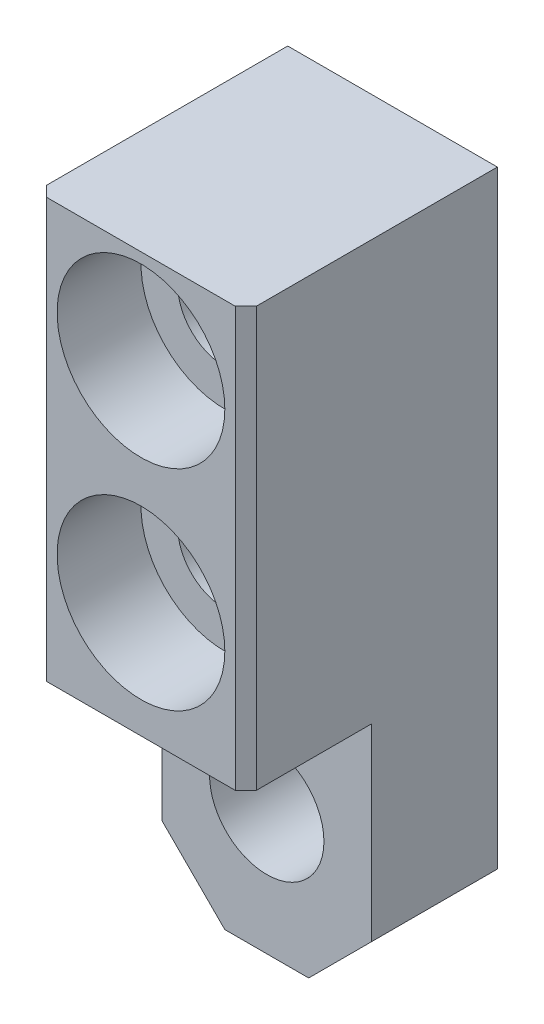
ISO-10303-21;
HEADER;
FILE_DESCRIPTION(('STEP AP214'),'2;1');
FILE_NAME('part.step','',(''),(''),'','','');
FILE_SCHEMA(('AUTOMOTIVE_DESIGN { 1 0 10303 214 1 1 1 1 }'));
ENDSEC;
DATA;
#1=APPLICATION_CONTEXT('core data for automotive mechanical design processes');
#2=APPLICATION_PROTOCOL_DEFINITION('international standard','automotive_design',2000,#1);
#3=PRODUCT_CONTEXT('',#1,'mechanical');
#4=PRODUCT('Part','Part','',(#3));
#5=PRODUCT_RELATED_PRODUCT_CATEGORY('part','',(#4));
#6=PRODUCT_DEFINITION_FORMATION('','',#4);
#7=PRODUCT_DEFINITION_CONTEXT('part definition',#1,'design');
#8=PRODUCT_DEFINITION('design','',#6,#7);
#9=PRODUCT_DEFINITION_SHAPE('','',#8);
#10=(LENGTH_UNIT() NAMED_UNIT(*) SI_UNIT(.MILLI.,.METRE.));
#11=(NAMED_UNIT(*) PLANE_ANGLE_UNIT() SI_UNIT($,.RADIAN.));
#12=(NAMED_UNIT(*) SI_UNIT($,.STERADIAN.) SOLID_ANGLE_UNIT());
#13=UNCERTAINTY_MEASURE_WITH_UNIT(LENGTH_MEASURE(1.E-05),#10,'distance_accuracy_value','');
#14=(GEOMETRIC_REPRESENTATION_CONTEXT(3) GLOBAL_UNCERTAINTY_ASSIGNED_CONTEXT((#13)) GLOBAL_UNIT_ASSIGNED_CONTEXT((#10,
#11,#12)) REPRESENTATION_CONTEXT('',''));
#15=CARTESIAN_POINT('',(0.,0.,0.));
#16=DIRECTION('',(0.,0.,1.));
#17=DIRECTION('',(1.,0.,0.));
#18=AXIS2_PLACEMENT_3D('',#15,#16,#17);
#19=CARTESIAN_POINT('',(5.,-14.5,0.));
#20=DIRECTION('',(0.,0.,1.));
#21=DIRECTION('',(1.,0.,0.));
#22=AXIS2_PLACEMENT_3D('',#19,#20,#21);
#23=CYLINDRICAL_SURFACE('',#22,2.25);
#24=CARTESIAN_POINT('',(5.,-14.5,0.));
#25=DIRECTION('',(0.,0.,1.));
#26=DIRECTION('',(1.,0.,0.));
#27=AXIS2_PLACEMENT_3D('',#24,#25,#26);
#28=CIRCLE('',#27,2.25);
#29=CARTESIAN_POINT('',(7.25,-14.5,0.));
#30=VERTEX_POINT('',#29);
#31=EDGE_CURVE('E138',#30,#30,#28,.T.);
#32=ORIENTED_EDGE('',*,*,#31,.F.);
#33=EDGE_LOOP('',(#32));
#34=FACE_BOUND('',#33,.T.);
#35=CARTESIAN_POINT('',(5.,-14.5,8.));
#36=DIRECTION('',(0.,0.,1.));
#37=DIRECTION('',(1.,0.,0.));
#38=AXIS2_PLACEMENT_3D('',#35,#36,#37);
#39=CIRCLE('',#38,2.25);
#40=CARTESIAN_POINT('',(7.25,-14.5,8.));
#41=VERTEX_POINT('',#40);
#42=EDGE_CURVE('E166',#41,#41,#39,.F.);
#43=ORIENTED_EDGE('',*,*,#42,.F.);
#44=EDGE_LOOP('',(#43));
#45=FACE_BOUND('',#44,.T.);
#46=ADVANCED_FACE('F33',(#34,#45),#23,.F.);
#47=CARTESIAN_POINT('',(5.,-4.5,0.));
#48=DIRECTION('',(0.,0.,1.));
#49=DIRECTION('',(1.,0.,0.));
#50=AXIS2_PLACEMENT_3D('',#47,#48,#49);
#51=CYLINDRICAL_SURFACE('',#50,2.25);
#52=CARTESIAN_POINT('',(5.,-4.5,0.));
#53=DIRECTION('',(0.,0.,1.));
#54=DIRECTION('',(1.,0.,0.));
#55=AXIS2_PLACEMENT_3D('',#52,#53,#54);
#56=CIRCLE('',#55,2.25);
#57=CARTESIAN_POINT('',(7.25,-4.5,0.));
#58=VERTEX_POINT('',#57);
#59=EDGE_CURVE('E133',#58,#58,#56,.T.);
#60=ORIENTED_EDGE('',*,*,#59,.F.);
#61=EDGE_LOOP('',(#60));
#62=FACE_BOUND('',#61,.T.);
#63=CARTESIAN_POINT('',(5.,-4.5,8.));
#64=DIRECTION('',(0.,0.,1.));
#65=DIRECTION('',(1.,0.,0.));
#66=AXIS2_PLACEMENT_3D('',#63,#64,#65);
#67=CIRCLE('',#66,2.25);
#68=CARTESIAN_POINT('',(7.25,-4.5,8.));
#69=VERTEX_POINT('',#68);
#70=EDGE_CURVE('E162',#69,#69,#67,.F.);
#71=ORIENTED_EDGE('',*,*,#70,.F.);
#72=EDGE_LOOP('',(#71));
#73=FACE_BOUND('',#72,.T.);
#74=ADVANCED_FACE('F243',(#62,#73),#51,.F.);
#75=CARTESIAN_POINT('',(0.,0.,6.));
#76=DIRECTION('',(1.,0.,0.));
#77=DIRECTION('',(0.,1.,0.));
#78=AXIS2_PLACEMENT_3D('',#75,#76,#77);
#79=PLANE('',#78);
#80=DIRECTION('',(0.,0.,-1.));
#81=VECTOR('',#80,1.);
#82=CARTESIAN_POINT('',(0.,-20.,12.));
#83=LINE('',#82,#81);
#84=CARTESIAN_POINT('',(0.,-20.,11.5));
#85=VERTEX_POINT('',#84);
#86=CARTESIAN_POINT('',(0.,-20.,6.));
#87=VERTEX_POINT('',#86);
#88=EDGE_CURVE('E116',#85,#87,#83,.T.);
#89=ORIENTED_EDGE('',*,*,#88,.F.);
#90=DIRECTION('',(0.,1.,0.));
#91=VECTOR('',#90,1.);
#92=CARTESIAN_POINT('',(0.,0.,11.5));
#93=LINE('',#92,#91);
#94=CARTESIAN_POINT('',(0.,0.,11.5));
#95=VERTEX_POINT('',#94);
#96=EDGE_CURVE('E11',#85,#95,#93,.T.);
#97=ORIENTED_EDGE('',*,*,#96,.T.);
#98=DIRECTION('',(0.,0.,-1.));
#99=VECTOR('',#98,1.);
#100=CARTESIAN_POINT('',(0.,0.,6.));
#101=LINE('',#100,#99);
#102=CARTESIAN_POINT('',(0.,0.,0.));
#103=VERTEX_POINT('',#102);
#104=EDGE_CURVE('E128',#95,#103,#101,.T.);
#105=ORIENTED_EDGE('',*,*,#104,.T.);
#106=DIRECTION('',(0.,-1.,0.));
#107=VECTOR('',#106,1.);
#108=CARTESIAN_POINT('',(0.,0.,0.));
#109=LINE('',#108,#107);
#110=CARTESIAN_POINT('',(0.,-29.,0.));
#111=VERTEX_POINT('',#110);
#112=EDGE_CURVE('E143',#103,#111,#109,.T.);
#113=ORIENTED_EDGE('',*,*,#112,.T.);
#114=DIRECTION('',(0.,0.,1.));
#115=VECTOR('',#114,1.);
#116=CARTESIAN_POINT('',(0.,-29.,6.));
#117=LINE('',#116,#115);
#118=CARTESIAN_POINT('',(0.,-29.,6.));
#119=VERTEX_POINT('',#118);
#120=EDGE_CURVE('E184',#111,#119,#117,.T.);
#121=ORIENTED_EDGE('',*,*,#120,.T.);
#122=DIRECTION('',(0.,-1.,0.));
#123=VECTOR('',#122,1.);
#124=CARTESIAN_POINT('',(0.,0.,6.));
#125=LINE('',#124,#123);
#126=EDGE_CURVE('E144',#87,#119,#125,.T.);
#127=ORIENTED_EDGE('',*,*,#126,.F.);
#128=EDGE_LOOP('',(#89,#97,#105,#113,#121,#127));
#129=FACE_BOUND('',#128,.T.);
#130=ADVANCED_FACE('F217',(#129),#79,.F.);
#131=CARTESIAN_POINT('',(0.,-32.,6.));
#132=DIRECTION('',(0.,1.,0.));
#133=DIRECTION('',(0.,0.,1.));
#134=AXIS2_PLACEMENT_3D('',#131,#132,#133);
#135=PLANE('',#134);
#136=DIRECTION('',(1.,0.,0.));
#137=VECTOR('',#136,1.);
#138=CARTESIAN_POINT('',(0.,-32.,0.));
#139=LINE('',#138,#137);
#140=CARTESIAN_POINT('',(3.,-32.,0.));
#141=VERTEX_POINT('',#140);
#142=CARTESIAN_POINT('',(6.99999999999999,-32.,0.));
#143=VERTEX_POINT('',#142);
#144=EDGE_CURVE('E150',#141,#143,#139,.T.);
#145=ORIENTED_EDGE('',*,*,#144,.T.);
#146=DIRECTION('',(0.,0.,1.));
#147=VECTOR('',#146,1.);
#148=CARTESIAN_POINT('',(6.99999999999999,-32.,6.));
#149=LINE('',#148,#147);
#150=CARTESIAN_POINT('',(6.99999999999999,-32.,6.));
#151=VERTEX_POINT('',#150);
#152=EDGE_CURVE('E179',#143,#151,#149,.T.);
#153=ORIENTED_EDGE('',*,*,#152,.T.);
#154=DIRECTION('',(1.,0.,0.));
#155=VECTOR('',#154,1.);
#156=CARTESIAN_POINT('',(0.,-32.,6.));
#157=LINE('',#156,#155);
#158=CARTESIAN_POINT('',(3.,-32.,6.));
#159=VERTEX_POINT('',#158);
#160=EDGE_CURVE('E129',#159,#151,#157,.T.);
#161=ORIENTED_EDGE('',*,*,#160,.F.);
#162=DIRECTION('',(0.,0.,-1.));
#163=VECTOR('',#162,1.);
#164=CARTESIAN_POINT('',(3.,-32.,6.));
#165=LINE('',#164,#163);
#166=EDGE_CURVE('E176',#159,#141,#165,.T.);
#167=ORIENTED_EDGE('',*,*,#166,.T.);
#168=EDGE_LOOP('',(#145,#153,#161,#167));
#169=FACE_BOUND('',#168,.T.);
#170=ADVANCED_FACE('F226',(#169),#135,.F.);
#171=CARTESIAN_POINT('',(10.,0.,6.));
#172=DIRECTION('',(-1.,0.,0.));
#173=DIRECTION('',(0.,-1.,0.));
#174=AXIS2_PLACEMENT_3D('',#171,#172,#173);
#175=PLANE('',#174);
#176=DIRECTION('',(0.,0.,-1.));
#177=VECTOR('',#176,1.);
#178=CARTESIAN_POINT('',(10.,0.,6.));
#179=LINE('',#178,#177);
#180=CARTESIAN_POINT('',(10.,0.,11.5));
#181=VERTEX_POINT('',#180);
#182=CARTESIAN_POINT('',(10.,0.,0.));
#183=VERTEX_POINT('',#182);
#184=EDGE_CURVE('E159',#181,#183,#179,.T.);
#185=ORIENTED_EDGE('',*,*,#184,.F.);
#186=DIRECTION('',(0.,-1.,0.));
#187=VECTOR('',#186,1.);
#188=CARTESIAN_POINT('',(10.,-20.,11.5));
#189=LINE('',#188,#187);
#190=CARTESIAN_POINT('',(10.,-20.,11.5));
#191=VERTEX_POINT('',#190);
#192=EDGE_CURVE('E56',#181,#191,#189,.T.);
#193=ORIENTED_EDGE('',*,*,#192,.T.);
#194=DIRECTION('',(0.,0.,-1.));
#195=VECTOR('',#194,1.);
#196=CARTESIAN_POINT('',(10.,-20.,12.));
#197=LINE('',#196,#195);
#198=CARTESIAN_POINT('',(10.,-20.,6.));
#199=VERTEX_POINT('',#198);
#200=EDGE_CURVE('E108',#191,#199,#197,.T.);
#201=ORIENTED_EDGE('',*,*,#200,.T.);
#202=DIRECTION('',(0.,1.,0.));
#203=VECTOR('',#202,1.);
#204=CARTESIAN_POINT('',(10.,0.,6.));
#205=LINE('',#204,#203);
#206=CARTESIAN_POINT('',(10.,-29.,6.));
#207=VERTEX_POINT('',#206);
#208=EDGE_CURVE('E112',#207,#199,#205,.T.);
#209=ORIENTED_EDGE('',*,*,#208,.F.);
#210=DIRECTION('',(0.,0.,-1.));
#211=VECTOR('',#210,1.);
#212=CARTESIAN_POINT('',(10.,-29.,6.));
#213=LINE('',#212,#211);
#214=CARTESIAN_POINT('',(10.,-29.,0.));
#215=VERTEX_POINT('',#214);
#216=EDGE_CURVE('E161',#207,#215,#213,.T.);
#217=ORIENTED_EDGE('',*,*,#216,.T.);
#218=DIRECTION('',(0.,1.,0.));
#219=VECTOR('',#218,1.);
#220=CARTESIAN_POINT('',(10.,0.,0.));
#221=LINE('',#220,#219);
#222=EDGE_CURVE('E153',#215,#183,#221,.T.);
#223=ORIENTED_EDGE('',*,*,#222,.T.);
#224=EDGE_LOOP('',(#185,#193,#201,#209,#217,#223));
#225=FACE_BOUND('',#224,.T.);
#226=ADVANCED_FACE('F110',(#225),#175,.F.);
#227=CARTESIAN_POINT('',(0.,0.,6.));
#228=DIRECTION('',(0.,-1.,0.));
#229=DIRECTION('',(0.,0.,-1.));
#230=AXIS2_PLACEMENT_3D('',#227,#228,#229);
#231=PLANE('',#230);
#232=DIRECTION('',(-1.,0.,0.));
#233=VECTOR('',#232,1.);
#234=CARTESIAN_POINT('',(0.,0.,12.));
#235=LINE('',#234,#233);
#236=CARTESIAN_POINT('',(9.5,0.,12.));
#237=VERTEX_POINT('',#236);
#238=CARTESIAN_POINT('',(0.500000000000004,0.,12.));
#239=VERTEX_POINT('',#238);
#240=EDGE_CURVE('E117',#237,#239,#235,.T.);
#241=ORIENTED_EDGE('',*,*,#240,.F.);
#242=DIRECTION('',(0.707106781186548,0.,-0.707106781186548));
#243=VECTOR('',#242,1.);
#244=CARTESIAN_POINT('',(9.5,0.,12.));
#245=LINE('',#244,#243);
#246=EDGE_CURVE('E194',#237,#181,#245,.T.);
#247=ORIENTED_EDGE('',*,*,#246,.T.);
#248=ORIENTED_EDGE('',*,*,#184,.T.);
#249=DIRECTION('',(-1.,0.,0.));
#250=VECTOR('',#249,1.);
#251=CARTESIAN_POINT('',(0.,0.,0.));
#252=LINE('',#251,#250);
#253=EDGE_CURVE('E146',#183,#103,#252,.T.);
#254=ORIENTED_EDGE('',*,*,#253,.T.);
#255=ORIENTED_EDGE('',*,*,#104,.F.);
#256=DIRECTION('',(0.707106781186548,0.,0.707106781186548));
#257=VECTOR('',#256,1.);
#258=CARTESIAN_POINT('',(0.500000000000004,0.,12.));
#259=LINE('',#258,#257);
#260=EDGE_CURVE('E192',#95,#239,#259,.T.);
#261=ORIENTED_EDGE('',*,*,#260,.T.);
#262=EDGE_LOOP('',(#241,#247,#248,#254,#255,#261));
#263=FACE_BOUND('',#262,.T.);
#264=ADVANCED_FACE('F206',(#263),#231,.F.);
#265=CARTESIAN_POINT('',(0.,0.,6.));
#266=DIRECTION('',(0.,0.,1.));
#267=DIRECTION('',(1.,0.,0.));
#268=AXIS2_PLACEMENT_3D('',#265,#266,#267);
#269=PLANE('',#268);
#270=CARTESIAN_POINT('',(5.,-26.,6.));
#271=DIRECTION('',(0.,0.,1.));
#272=DIRECTION('',(1.,0.,0.));
#273=AXIS2_PLACEMENT_3D('',#270,#271,#272);
#274=CIRCLE('',#273,2.72723826723719);
#275=CARTESIAN_POINT('',(7.72723826723719,-26.,6.));
#276=VERTEX_POINT('',#275);
#277=EDGE_CURVE('E376',#276,#276,#274,.T.);
#278=ORIENTED_EDGE('',*,*,#277,.F.);
#279=EDGE_LOOP('',(#278));
#280=FACE_BOUND('',#279,.T.);
#281=ORIENTED_EDGE('',*,*,#160,.T.);
#282=DIRECTION('',(-0.707106781186549,-0.707106781186546,0.));
#283=VECTOR('',#282,1.);
#284=CARTESIAN_POINT('',(19.5,-19.5000000000001,6.));
#285=LINE('',#284,#283);
#286=EDGE_CURVE('E127',#151,#207,#285,.F.);
#287=ORIENTED_EDGE('',*,*,#286,.T.);
#288=ORIENTED_EDGE('',*,*,#208,.T.);
#289=DIRECTION('',(1.,0.,0.));
#290=VECTOR('',#289,1.);
#291=CARTESIAN_POINT('',(0.,-20.,6.));
#292=LINE('',#291,#290);
#293=EDGE_CURVE('E124',#87,#199,#292,.T.);
#294=ORIENTED_EDGE('',*,*,#293,.F.);
#295=ORIENTED_EDGE('',*,*,#126,.T.);
#296=DIRECTION('',(-0.707106781186546,0.707106781186549,0.));
#297=VECTOR('',#296,1.);
#298=CARTESIAN_POINT('',(-14.5,-14.4999999999999,6.));
#299=LINE('',#298,#297);
#300=EDGE_CURVE('E181',#119,#159,#299,.F.);
#301=ORIENTED_EDGE('',*,*,#300,.T.);
#302=EDGE_LOOP('',(#281,#287,#288,#294,#295,#301));
#303=FACE_BOUND('',#302,.T.);
#304=ADVANCED_FACE('F122',(#280,#303),#269,.T.);
#305=CARTESIAN_POINT('',(0.,0.,0.));
#306=DIRECTION('',(0.,0.,1.));
#307=DIRECTION('',(1.,0.,0.));
#308=AXIS2_PLACEMENT_3D('',#305,#306,#307);
#309=PLANE('',#308);
#310=CARTESIAN_POINT('',(5.,-26.,0.));
#311=DIRECTION('',(0.,0.,1.));
#312=DIRECTION('',(1.,0.,0.));
#313=AXIS2_PLACEMENT_3D('',#310,#311,#312);
#314=CIRCLE('',#313,2.72723826723719);
#315=CARTESIAN_POINT('',(7.72723826723719,-26.,0.));
#316=VERTEX_POINT('',#315);
#317=EDGE_CURVE('E373',#316,#316,#314,.T.);
#318=ORIENTED_EDGE('',*,*,#317,.T.);
#319=EDGE_LOOP('',(#318));
#320=FACE_BOUND('',#319,.T.);
#321=ORIENTED_EDGE('',*,*,#31,.T.);
#322=EDGE_LOOP('',(#321));
#323=FACE_BOUND('',#322,.T.);
#324=ORIENTED_EDGE('',*,*,#59,.T.);
#325=EDGE_LOOP('',(#324));
#326=FACE_BOUND('',#325,.T.);
#327=ORIENTED_EDGE('',*,*,#222,.F.);
#328=DIRECTION('',(0.707106781186549,0.707106781186546,0.));
#329=VECTOR('',#328,1.);
#330=CARTESIAN_POINT('',(10.,-29.,0.));
#331=LINE('',#330,#329);
#332=EDGE_CURVE('E174',#215,#143,#331,.F.);
#333=ORIENTED_EDGE('',*,*,#332,.T.);
#334=ORIENTED_EDGE('',*,*,#144,.F.);
#335=DIRECTION('',(0.707106781186546,-0.707106781186549,0.));
#336=VECTOR('',#335,1.);
#337=CARTESIAN_POINT('',(3.,-32.,0.));
#338=LINE('',#337,#336);
#339=EDGE_CURVE('E172',#141,#111,#338,.F.);
#340=ORIENTED_EDGE('',*,*,#339,.T.);
#341=ORIENTED_EDGE('',*,*,#112,.F.);
#342=ORIENTED_EDGE('',*,*,#253,.F.);
#343=EDGE_LOOP('',(#327,#333,#334,#340,#341,#342));
#344=FACE_BOUND('',#343,.T.);
#345=ADVANCED_FACE('F211',(#320,#323,#326,#344),#309,.F.);
#346=CARTESIAN_POINT('',(0.,-20.,12.));
#347=DIRECTION('',(0.,1.,0.));
#348=DIRECTION('',(0.,0.,1.));
#349=AXIS2_PLACEMENT_3D('',#346,#347,#348);
#350=PLANE('',#349);
#351=ORIENTED_EDGE('',*,*,#200,.F.);
#352=DIRECTION('',(-0.707106781186548,0.,0.707106781186548));
#353=VECTOR('',#352,1.);
#354=CARTESIAN_POINT('',(9.5,-20.,12.));
#355=LINE('',#354,#353);
#356=CARTESIAN_POINT('',(9.5,-20.,12.));
#357=VERTEX_POINT('',#356);
#358=EDGE_CURVE('E41',#191,#357,#355,.T.);
#359=ORIENTED_EDGE('',*,*,#358,.T.);
#360=DIRECTION('',(1.,0.,0.));
#361=VECTOR('',#360,1.);
#362=CARTESIAN_POINT('',(0.,-20.,12.));
#363=LINE('',#362,#361);
#364=CARTESIAN_POINT('',(0.500000000000006,-20.,12.));
#365=VERTEX_POINT('',#364);
#366=EDGE_CURVE('E132',#365,#357,#363,.T.);
#367=ORIENTED_EDGE('',*,*,#366,.F.);
#368=DIRECTION('',(-0.707106781186548,0.,-0.707106781186548));
#369=VECTOR('',#368,1.);
#370=CARTESIAN_POINT('',(0.500000000000005,-20.,12.));
#371=LINE('',#370,#369);
#372=EDGE_CURVE('E48',#365,#85,#371,.T.);
#373=ORIENTED_EDGE('',*,*,#372,.T.);
#374=ORIENTED_EDGE('',*,*,#88,.T.);
#375=ORIENTED_EDGE('',*,*,#293,.T.);
#376=EDGE_LOOP('',(#351,#359,#367,#373,#374,#375));
#377=FACE_BOUND('',#376,.T.);
#378=ADVANCED_FACE('F131',(#377),#350,.F.);
#379=CARTESIAN_POINT('',(0.,0.,12.));
#380=DIRECTION('',(0.,0.,1.));
#381=DIRECTION('',(1.,0.,0.));
#382=AXIS2_PLACEMENT_3D('',#379,#380,#381);
#383=PLANE('',#382);
#384=CARTESIAN_POINT('',(5.,-14.5,12.));
#385=DIRECTION('',(0.,0.,1.));
#386=DIRECTION('',(1.,0.,0.));
#387=AXIS2_PLACEMENT_3D('',#384,#385,#386);
#388=CIRCLE('',#387,4.);
#389=CARTESIAN_POINT('',(9.,-14.5,12.));
#390=VERTEX_POINT('',#389);
#391=EDGE_CURVE('E378',#390,#390,#388,.T.);
#392=ORIENTED_EDGE('',*,*,#391,.F.);
#393=EDGE_LOOP('',(#392));
#394=FACE_BOUND('',#393,.T.);
#395=CARTESIAN_POINT('',(5.,-4.5,12.));
#396=DIRECTION('',(0.,0.,1.));
#397=DIRECTION('',(1.,0.,0.));
#398=AXIS2_PLACEMENT_3D('',#395,#396,#397);
#399=CIRCLE('',#398,4.);
#400=CARTESIAN_POINT('',(9.,-4.5,12.));
#401=VERTEX_POINT('',#400);
#402=EDGE_CURVE('E169',#401,#401,#399,.T.);
#403=ORIENTED_EDGE('',*,*,#402,.F.);
#404=EDGE_LOOP('',(#403));
#405=FACE_BOUND('',#404,.T.);
#406=ORIENTED_EDGE('',*,*,#366,.T.);
#407=DIRECTION('',(0.,1.,0.));
#408=VECTOR('',#407,1.);
#409=CARTESIAN_POINT('',(9.5,0.,12.));
#410=LINE('',#409,#408);
#411=EDGE_CURVE('E189',#357,#237,#410,.T.);
#412=ORIENTED_EDGE('',*,*,#411,.T.);
#413=ORIENTED_EDGE('',*,*,#240,.T.);
#414=DIRECTION('',(0.,-1.,0.));
#415=VECTOR('',#414,1.);
#416=CARTESIAN_POINT('',(0.500000000000006,-20.,12.));
#417=LINE('',#416,#415);
#418=EDGE_CURVE('E186',#239,#365,#417,.T.);
#419=ORIENTED_EDGE('',*,*,#418,.T.);
#420=EDGE_LOOP('',(#406,#412,#413,#419));
#421=FACE_BOUND('',#420,.T.);
#422=ADVANCED_FACE('F200',(#394,#405,#421),#383,.T.);
#423=CARTESIAN_POINT('',(5.,-4.5,8.));
#424=DIRECTION('',(0.,0.,1.));
#425=DIRECTION('',(1.,0.,0.));
#426=AXIS2_PLACEMENT_3D('',#423,#424,#425);
#427=PLANE('',#426);
#428=CARTESIAN_POINT('',(5.,-4.5,8.));
#429=DIRECTION('',(0.,0.,1.));
#430=DIRECTION('',(1.,0.,0.));
#431=AXIS2_PLACEMENT_3D('',#428,#429,#430);
#432=CIRCLE('',#431,4.);
#433=CARTESIAN_POINT('',(9.,-4.5,8.));
#434=VERTEX_POINT('',#433);
#435=EDGE_CURVE('E165',#434,#434,#432,.T.);
#436=ORIENTED_EDGE('',*,*,#435,.T.);
#437=EDGE_LOOP('',(#436));
#438=FACE_BOUND('',#437,.T.);
#439=ORIENTED_EDGE('',*,*,#70,.T.);
#440=EDGE_LOOP('',(#439));
#441=FACE_BOUND('',#440,.T.);
#442=ADVANCED_FACE('F259',(#438,#441),#427,.T.);
#443=CARTESIAN_POINT('',(5.,-4.5,8.));
#444=DIRECTION('',(0.,0.,1.));
#445=DIRECTION('',(1.,0.,0.));
#446=AXIS2_PLACEMENT_3D('',#443,#444,#445);
#447=CYLINDRICAL_SURFACE('',#446,4.);
#448=ORIENTED_EDGE('',*,*,#435,.F.);
#449=EDGE_LOOP('',(#448));
#450=FACE_BOUND('',#449,.T.);
#451=ORIENTED_EDGE('',*,*,#402,.T.);
#452=EDGE_LOOP('',(#451));
#453=FACE_BOUND('',#452,.T.);
#454=ADVANCED_FACE('F254',(#450,#453),#447,.F.);
#455=CARTESIAN_POINT('',(5.,-14.5,8.));
#456=DIRECTION('',(0.,0.,1.));
#457=DIRECTION('',(1.,0.,0.));
#458=AXIS2_PLACEMENT_3D('',#455,#456,#457);
#459=PLANE('',#458);
#460=CARTESIAN_POINT('',(5.,-14.5,8.));
#461=DIRECTION('',(0.,0.,1.));
#462=DIRECTION('',(1.,0.,0.));
#463=AXIS2_PLACEMENT_3D('',#460,#461,#462);
#464=CIRCLE('',#463,4.);
#465=CARTESIAN_POINT('',(9.,-14.5,8.));
#466=VERTEX_POINT('',#465);
#467=EDGE_CURVE('E170',#466,#466,#464,.T.);
#468=ORIENTED_EDGE('',*,*,#467,.T.);
#469=EDGE_LOOP('',(#468));
#470=FACE_BOUND('',#469,.T.);
#471=ORIENTED_EDGE('',*,*,#42,.T.);
#472=EDGE_LOOP('',(#471));
#473=FACE_BOUND('',#472,.T.);
#474=ADVANCED_FACE('F238',(#470,#473),#459,.T.);
#475=CARTESIAN_POINT('',(5.,-14.5,8.));
#476=DIRECTION('',(0.,0.,1.));
#477=DIRECTION('',(1.,0.,0.));
#478=AXIS2_PLACEMENT_3D('',#475,#476,#477);
#479=CYLINDRICAL_SURFACE('',#478,4.);
#480=ORIENTED_EDGE('',*,*,#467,.F.);
#481=EDGE_LOOP('',(#480));
#482=FACE_BOUND('',#481,.T.);
#483=ORIENTED_EDGE('',*,*,#391,.T.);
#484=EDGE_LOOP('',(#483));
#485=FACE_BOUND('',#484,.T.);
#486=ADVANCED_FACE('F231',(#482,#485),#479,.F.);
#487=CARTESIAN_POINT('',(10.,-29.,6.));
#488=DIRECTION('',(-0.707106781186546,0.707106781186549,0.));
#489=DIRECTION('',(0.,0.,-1.));
#490=AXIS2_PLACEMENT_3D('',#487,#488,#489);
#491=PLANE('',#490);
#492=ORIENTED_EDGE('',*,*,#286,.F.);
#493=ORIENTED_EDGE('',*,*,#152,.F.);
#494=ORIENTED_EDGE('',*,*,#332,.F.);
#495=ORIENTED_EDGE('',*,*,#216,.F.);
#496=EDGE_LOOP('',(#492,#493,#494,#495));
#497=FACE_BOUND('',#496,.T.);
#498=ADVANCED_FACE('F229',(#497),#491,.F.);
#499=CARTESIAN_POINT('',(3.,-32.,6.));
#500=DIRECTION('',(0.707106781186549,0.707106781186546,0.));
#501=DIRECTION('',(0.,0.,-1.));
#502=AXIS2_PLACEMENT_3D('',#499,#500,#501);
#503=PLANE('',#502);
#504=ORIENTED_EDGE('',*,*,#300,.F.);
#505=ORIENTED_EDGE('',*,*,#120,.F.);
#506=ORIENTED_EDGE('',*,*,#339,.F.);
#507=ORIENTED_EDGE('',*,*,#166,.F.);
#508=EDGE_LOOP('',(#504,#505,#506,#507));
#509=FACE_BOUND('',#508,.T.);
#510=ADVANCED_FACE('F223',(#509),#503,.F.);
#511=CARTESIAN_POINT('',(9.5,0.,12.));
#512=DIRECTION('',(0.707106781186547,0.,0.707106781186547));
#513=DIRECTION('',(0.,-1.,0.));
#514=AXIS2_PLACEMENT_3D('',#511,#512,#513);
#515=PLANE('',#514);
#516=ORIENTED_EDGE('',*,*,#358,.F.);
#517=ORIENTED_EDGE('',*,*,#192,.F.);
#518=ORIENTED_EDGE('',*,*,#246,.F.);
#519=ORIENTED_EDGE('',*,*,#411,.F.);
#520=EDGE_LOOP('',(#516,#517,#518,#519));
#521=FACE_BOUND('',#520,.T.);
#522=ADVANCED_FACE('F204',(#521),#515,.T.);
#523=CARTESIAN_POINT('',(0.500000000000004,0.,12.));
#524=DIRECTION('',(-0.707106781186547,0.,0.707106781186547));
#525=DIRECTION('',(0.,1.,0.));
#526=AXIS2_PLACEMENT_3D('',#523,#524,#525);
#527=PLANE('',#526);
#528=ORIENTED_EDGE('',*,*,#260,.F.);
#529=ORIENTED_EDGE('',*,*,#96,.F.);
#530=ORIENTED_EDGE('',*,*,#372,.F.);
#531=ORIENTED_EDGE('',*,*,#418,.F.);
#532=EDGE_LOOP('',(#528,#529,#530,#531));
#533=FACE_BOUND('',#532,.T.);
#534=ADVANCED_FACE('F35',(#533),#527,.T.);
#535=CARTESIAN_POINT('',(5.,-26.,0.));
#536=DIRECTION('',(0.,0.,1.));
#537=DIRECTION('',(1.,0.,0.));
#538=AXIS2_PLACEMENT_3D('',#535,#536,#537);
#539=CYLINDRICAL_SURFACE('',#538,2.72723826723719);
#540=ORIENTED_EDGE('',*,*,#317,.F.);
#541=EDGE_LOOP('',(#540));
#542=FACE_BOUND('',#541,.T.);
#543=ORIENTED_EDGE('',*,*,#277,.T.);
#544=EDGE_LOOP('',(#543));
#545=FACE_BOUND('',#544,.T.);
#546=ADVANCED_FACE('F358',(#542,#545),#539,.F.);
#547=CLOSED_SHELL('',(#46,#74,#130,#170,#226,#264,#304,#345,#378,#422,#442,#454,#474,#486,#498,
#510,#522,#534,#546));
#548=MANIFOLD_SOLID_BREP('B2',#547);
#549=ADVANCED_BREP_SHAPE_REPRESENTATION('',(#18,#548),#14);
#550=SHAPE_DEFINITION_REPRESENTATION(#9,#549);
ENDSEC;
END-ISO-10303-21;
